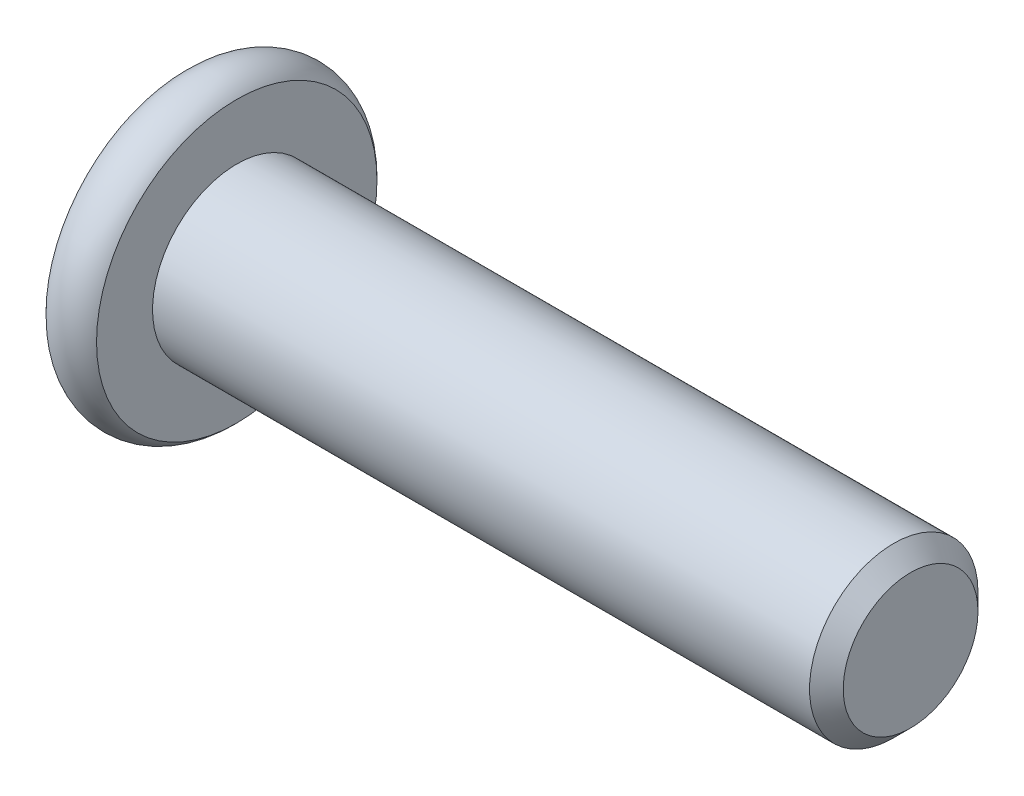
ISO-10303-21;
HEADER;
FILE_DESCRIPTION(('STEP AP214'),'2;1');
FILE_NAME('part.step','',(''),(''),'','','');
FILE_SCHEMA(('AUTOMOTIVE_DESIGN { 1 0 10303 214 1 1 1 1 }'));
ENDSEC;
DATA;
#1=APPLICATION_CONTEXT('core data for automotive mechanical design processes');
#2=APPLICATION_PROTOCOL_DEFINITION('international standard','automotive_design',2000,#1);
#3=PRODUCT_CONTEXT('',#1,'mechanical');
#4=PRODUCT('Part','Part','',(#3));
#5=PRODUCT_RELATED_PRODUCT_CATEGORY('part','',(#4));
#6=PRODUCT_DEFINITION_FORMATION('','',#4);
#7=PRODUCT_DEFINITION_CONTEXT('part definition',#1,'design');
#8=PRODUCT_DEFINITION('design','',#6,#7);
#9=PRODUCT_DEFINITION_SHAPE('','',#8);
#10=(LENGTH_UNIT() NAMED_UNIT(*) SI_UNIT(.MILLI.,.METRE.));
#11=(NAMED_UNIT(*) PLANE_ANGLE_UNIT() SI_UNIT($,.RADIAN.));
#12=(NAMED_UNIT(*) SI_UNIT($,.STERADIAN.) SOLID_ANGLE_UNIT());
#13=UNCERTAINTY_MEASURE_WITH_UNIT(LENGTH_MEASURE(1.E-05),#10,'distance_accuracy_value','');
#14=(GEOMETRIC_REPRESENTATION_CONTEXT(3) GLOBAL_UNCERTAINTY_ASSIGNED_CONTEXT((#13)) GLOBAL_UNIT_ASSIGNED_CONTEXT((#10,
#11,#12)) REPRESENTATION_CONTEXT('',''));
#15=CARTESIAN_POINT('',(0.,0.,0.));
#16=DIRECTION('',(0.,0.,1.));
#17=DIRECTION('',(1.,0.,0.));
#18=AXIS2_PLACEMENT_3D('',#15,#16,#17);
#19=CARTESIAN_POINT('',(-20.,0.,2.22044604925031E-13));
#20=DIRECTION('',(1.,0.,0.));
#21=DIRECTION('',(0.,0.,-1.));
#22=AXIS2_PLACEMENT_3D('',#19,#20,#21);
#23=CYLINDRICAL_SURFACE('',#22,2.5);
#24=CARTESIAN_POINT('',(-0.500000000000056,0.,0.));
#25=DIRECTION('',(1.,0.,0.));
#26=DIRECTION('',(0.,0.,-1.));
#27=AXIS2_PLACEMENT_3D('',#24,#25,#26);
#28=CIRCLE('',#27,2.5);
#29=CARTESIAN_POINT('',(-0.500000000000056,0.,-2.5));
#30=VERTEX_POINT('',#29);
#31=EDGE_CURVE('E48',#30,#30,#28,.F.);
#32=ORIENTED_EDGE('',*,*,#31,.T.);
#33=EDGE_LOOP('',(#32));
#34=FACE_BOUND('',#33,.T.);
#35=CARTESIAN_POINT('',(-20.,0.,2.22044604925031E-13));
#36=DIRECTION('',(-1.,0.,0.));
#37=DIRECTION('',(0.,-1.,0.));
#38=AXIS2_PLACEMENT_3D('',#35,#36,#37);
#39=CIRCLE('',#38,2.5);
#40=CARTESIAN_POINT('',(-20.,-2.50000000000006,2.22183382803109E-13));
#41=VERTEX_POINT('',#40);
#42=EDGE_CURVE('E124',#41,#41,#39,.F.);
#43=ORIENTED_EDGE('',*,*,#42,.T.);
#44=EDGE_LOOP('',(#43));
#45=FACE_BOUND('',#44,.T.);
#46=ADVANCED_FACE('F34',(#34,#45),#23,.T.);
#47=CARTESIAN_POINT('',(0.,0.,0.));
#48=DIRECTION('',(1.,0.,0.));
#49=DIRECTION('',(0.,0.,-1.));
#50=AXIS2_PLACEMENT_3D('',#47,#48,#49);
#51=PLANE('',#50);
#52=CARTESIAN_POINT('',(0.,0.,0.));
#53=DIRECTION('',(1.,0.,0.));
#54=DIRECTION('',(0.,0.,-1.));
#55=AXIS2_PLACEMENT_3D('',#52,#53,#54);
#56=CIRCLE('',#55,2.);
#57=CARTESIAN_POINT('',(0.,0.,-2.));
#58=VERTEX_POINT('',#57);
#59=EDGE_CURVE('E127',#58,#58,#56,.T.);
#60=ORIENTED_EDGE('',*,*,#59,.T.);
#61=EDGE_LOOP('',(#60));
#62=FACE_BOUND('',#61,.T.);
#63=ADVANCED_FACE('F137',(#62),#51,.T.);
#64=CARTESIAN_POINT('',(0.,0.,0.));
#65=DIRECTION('',(-1.,0.,0.));
#66=DIRECTION('',(0.,0.,1.));
#67=AXIS2_PLACEMENT_3D('',#64,#65,#66);
#68=CONICAL_SURFACE('',#67,2.,0.785398163397446);
#69=ORIENTED_EDGE('',*,*,#31,.F.);
#70=EDGE_LOOP('',(#69));
#71=FACE_BOUND('',#70,.T.);
#72=ORIENTED_EDGE('',*,*,#59,.F.);
#73=EDGE_LOOP('',(#72));
#74=FACE_BOUND('',#73,.T.);
#75=ADVANCED_FACE('F36',(#71,#74),#68,.T.);
#76=CARTESIAN_POINT('',(-21.5,0.,2.22044604925031E-13));
#77=DIRECTION('',(1.,0.,0.));
#78=DIRECTION('',(0.,1.,0.));
#79=AXIS2_PLACEMENT_3D('',#76,#77,#78);
#80=PLANE('',#79);
#81=CARTESIAN_POINT('',(-21.5,1.66533453693773E-13,0.));
#82=DIRECTION('',(-1.,0.,0.));
#83=DIRECTION('',(0.,-1.,0.));
#84=AXIS2_PLACEMENT_3D('',#81,#82,#83);
#85=CIRCLE('',#84,1.78205080756886);
#86=CARTESIAN_POINT('',(-21.5,-1.78205080756869,0.));
#87=VERTEX_POINT('',#86);
#88=EDGE_CURVE('E242',#87,#87,#85,.T.);
#89=ORIENTED_EDGE('',*,*,#88,.F.);
#90=EDGE_LOOP('',(#89));
#91=FACE_BOUND('',#90,.T.);
#92=CARTESIAN_POINT('',(-21.5,0.,2.22044604925031E-13));
#93=DIRECTION('',(-1.,0.,0.));
#94=DIRECTION('',(0.,-1.,0.));
#95=AXIS2_PLACEMENT_3D('',#92,#93,#94);
#96=CIRCLE('',#95,4.16143782776615);
#97=CARTESIAN_POINT('',(-21.5,-4.16143782776621,2.22275611129628E-13));
#98=VERTEX_POINT('',#97);
#99=EDGE_CURVE('E121',#98,#98,#96,.T.);
#100=ORIENTED_EDGE('',*,*,#99,.T.);
#101=EDGE_LOOP('',(#100));
#102=FACE_BOUND('',#101,.T.);
#103=ADVANCED_FACE('F136',(#91,#102),#80,.F.);
#104=CARTESIAN_POINT('',(-20.75,0.,2.22044604925031E-13));
#105=DIRECTION('',(-1.,0.,0.));
#106=DIRECTION('',(0.,-1.,0.));
#107=AXIS2_PLACEMENT_3D('',#104,#105,#106);
#108=TOROIDAL_SURFACE('',#107,3.5,1.);
#109=ORIENTED_EDGE('',*,*,#99,.F.);
#110=EDGE_LOOP('',(#109));
#111=FACE_BOUND('',#110,.T.);
#112=CARTESIAN_POINT('',(-20.,0.,2.22044604925031E-13));
#113=DIRECTION('',(-1.,0.,0.));
#114=DIRECTION('',(0.,-1.,0.));
#115=AXIS2_PLACEMENT_3D('',#112,#113,#114);
#116=CIRCLE('',#115,4.16143782776615);
#117=CARTESIAN_POINT('',(-20.,-4.16143782776621,2.22275611129628E-13));
#118=VERTEX_POINT('',#117);
#119=EDGE_CURVE('E118',#118,#118,#116,.T.);
#120=ORIENTED_EDGE('',*,*,#119,.T.);
#121=EDGE_LOOP('',(#120));
#122=FACE_BOUND('',#121,.T.);
#123=ADVANCED_FACE('F148',(#111,#122),#108,.T.);
#124=CARTESIAN_POINT('',(-20.,4.16143782776629,2.22044604925031E-13));
#125=DIRECTION('',(-1.,0.,0.));
#126=DIRECTION('',(0.,-1.,0.));
#127=AXIS2_PLACEMENT_3D('',#124,#125,#126);
#128=PLANE('',#127);
#129=ORIENTED_EDGE('',*,*,#42,.F.);
#130=EDGE_LOOP('',(#129));
#131=FACE_BOUND('',#130,.T.);
#132=ORIENTED_EDGE('',*,*,#119,.F.);
#133=EDGE_LOOP('',(#132));
#134=FACE_BOUND('',#133,.T.);
#135=ADVANCED_FACE('F152',(#131,#134),#128,.F.);
#136=CARTESIAN_POINT('',(-21.5,1.66533453693773E-13,0.));
#137=DIRECTION('',(-1.,0.,0.));
#138=DIRECTION('',(0.,-1.,0.));
#139=AXIS2_PLACEMENT_3D('',#136,#137,#138);
#140=CONICAL_SURFACE('',#139,1.78205080756886,0.78539816339745);
#141=ORIENTED_EDGE('',*,*,#88,.T.);
#142=EDGE_LOOP('',(#141));
#143=FACE_BOUND('',#142,.T.);
#144=CARTESIAN_POINT('',(-22.015428085613,-1.74023253176592,1.50000000000039));
#145=CARTESIAN_POINT('',(-21.9833811073447,-1.69791724929735,1.50000000000032));
#146=CARTESIAN_POINT('',(-21.9516444672843,-1.65536760966792,1.50000000000029));
#147=CARTESIAN_POINT('',(-21.8889203936156,-1.56970398156683,1.50000000000027));
#148=CARTESIAN_POINT('',(-21.8579331482203,-1.52658985542849,1.50000000000028));
#149=CARTESIAN_POINT('',(-21.7658461643452,-1.39562626326564,1.50000000000028));
#150=CARTESIAN_POINT('',(-21.7061145123023,-1.30679868010574,1.50000000000026));
#151=CARTESIAN_POINT('',(-21.5887342891015,-1.12044622640207,1.5000000000003));
#152=CARTESIAN_POINT('',(-21.5314082774826,-1.0227158730666,1.50000000000037));
#153=CARTESIAN_POINT('',(-21.4264632149761,-0.822357214965245,1.50000000000019));
#154=CARTESIAN_POINT('',(-21.3788114236894,-0.719746931702063,1.49999999999994));
#155=CARTESIAN_POINT('',(-21.3205099883151,-0.56585238709519,1.50000000000011));
#156=CARTESIAN_POINT('',(-21.3037990535411,-0.51687419142472,1.50000000000024));
#157=CARTESIAN_POINT('',(-21.2743077515092,-0.41772398845751,1.50000000000032));
#158=CARTESIAN_POINT('',(-21.2615276514222,-0.367551900263887,1.50000000000027));
#159=CARTESIAN_POINT('',(-21.240778420246,-0.267158299056132,1.50000000000028));
#160=CARTESIAN_POINT('',(-21.2327260618263,-0.216954261864853,1.50000000000034));
#161=CARTESIAN_POINT('',(-21.2215916368342,-0.115994915871317,1.50000000000022));
#162=CARTESIAN_POINT('',(-21.2185086886377,-0.0652397064615469,1.50000000000005));
#163=CARTESIAN_POINT('',(-21.2175473897404,0.0344222234875186,1.50000000000006));
#164=CARTESIAN_POINT('',(-21.2194789216953,0.0833271701100345,1.50000000000022));
#165=CARTESIAN_POINT('',(-21.228017572968,0.18072429312715,1.50000000000033));
#166=CARTESIAN_POINT('',(-21.2346251420483,0.229216429361659,1.50000000000028));
#167=CARTESIAN_POINT('',(-21.2522650626449,0.32625802769693,1.50000000000027));
#168=CARTESIAN_POINT('',(-21.2633731682012,0.37479350744994,1.50000000000032));
#169=CARTESIAN_POINT('',(-21.2894198669597,0.470802295834104,1.50000000000024));
#170=CARTESIAN_POINT('',(-21.3043581560035,0.518275688481227,1.50000000000011));
#171=CARTESIAN_POINT('',(-21.3568395457159,0.667150562065092,1.49999999999994));
#172=CARTESIAN_POINT('',(-21.4003351165442,0.766448362426739,1.50000000000019));
#173=CARTESIAN_POINT('',(-21.4970587814838,0.960384405673684,1.50000000000037));
#174=CARTESIAN_POINT('',(-21.5503217226675,1.05500437383609,1.50000000000031));
#175=CARTESIAN_POINT('',(-21.6602258010454,1.23584520321524,1.50000000000025));
#176=CARTESIAN_POINT('',(-21.7165682531047,1.32224986946543,1.50000000000026));
#177=CARTESIAN_POINT('',(-21.8036755725971,1.44954953726468,1.50000000000029));
#178=CARTESIAN_POINT('',(-21.8330199906839,1.49143368482417,1.5000000000003));
#179=CARTESIAN_POINT('',(-21.8924869182931,1.57462914783238,1.50000000000026));
#180=CARTESIAN_POINT('',(-21.9226092115007,1.61594061772573,1.50000000000019));
#181=CARTESIAN_POINT('',(-21.9530541181365,1.65701358742548,1.50000000000006));
#182=B_SPLINE_CURVE_WITH_KNOTS('',3,(#144,#145,#146,#147,#148,#149,#150,#151,#152,#153,#154,
#155,#156,#157,#158,#159,#160,#161,#162,#163,#164,#165,#166,#167,#168,#169,#170,#171,#172,#173,
#174,#175,#176,#177,#178,#179,#180,#181),.UNSPECIFIED.,.F.,.F.,(4,2,2,2,2,2,2,2,2,2,2,2,2,2,2,2,
2,2,4),(0.,0.159238974218315,0.318517535014476,0.639504781932392,0.979137893799231,
1.31760168934353,1.47272233841619,1.62785352839773,1.78016486537347,1.93244917778278,
2.07904486260292,2.22565464958326,2.37484213303392,2.52401777304029,2.8482836528376,
3.17372975666736,3.48303030530528,3.63644667013898,3.78982082222899),.UNSPECIFIED.);
#183=CARTESIAN_POINT('',(-21.4500000000001,-0.866025403784554,1.50000000000028));
#184=VERTEX_POINT('',#183);
#185=CARTESIAN_POINT('',(-21.45,0.866025403784387,1.50000000000017));
#186=VERTEX_POINT('',#185);
#187=EDGE_CURVE('E102',#184,#186,#182,.T.);
#188=ORIENTED_EDGE('',*,*,#187,.F.);
#189=CARTESIAN_POINT('',(-21.4501154816001,-1.73216627762274,-0.000199999999672684));
#190=CARTESIAN_POINT('',(-21.4203654760676,-1.70239359975924,0.0513677907374837));
#191=CARTESIAN_POINT('',(-21.3923624839106,-1.67212305186367,0.103797917665623));
#192=CARTESIAN_POINT('',(-21.3410892304405,-1.61039789003631,0.21070903405604));
#193=CARTESIAN_POINT('',(-21.3178475050447,-1.57893740312624,0.265200195815113));
#194=CARTESIAN_POINT('',(-21.2780337289926,-1.51549879897996,0.375079081357747));
#195=CARTESIAN_POINT('',(-21.2613615856714,-1.48353684526821,0.430438809095736));
#196=CARTESIAN_POINT('',(-21.2356744568184,-1.41890915196216,0.542377257477631));
#197=CARTESIAN_POINT('',(-21.2266402904789,-1.38624538781116,0.598952556553395));
#198=CARTESIAN_POINT('',(-21.218489081227,-1.32995210095303,0.696455389516801));
#199=CARTESIAN_POINT('',(-21.2172822529896,-1.30639533311136,0.737256908280851));
#200=CARTESIAN_POINT('',(-21.2193140571628,-1.25932335290211,0.818787969616243));
#201=CARTESIAN_POINT('',(-21.2225536707488,-1.23580815085328,0.859517494314989));
#202=CARTESIAN_POINT('',(-21.2332919859824,-1.18900414978446,0.940584402163756));
#203=CARTESIAN_POINT('',(-21.2407946530193,-1.16571558211746,0.980921384598634));
#204=CARTESIAN_POINT('',(-21.2596516119287,-1.11952932016346,1.0609183369143));
#205=CARTESIAN_POINT('',(-21.2710075570187,-1.09663179808774,1.10057800851639));
#206=CARTESIAN_POINT('',(-21.3047216475926,-1.03798159809673,1.2021631347746));
#207=CARTESIAN_POINT('',(-21.3296218490937,-1.00259267147477,1.26345855370988));
#208=CARTESIAN_POINT('',(-21.371656653272,-0.950557780604678,1.35358562846354));
#209=CARTESIAN_POINT('',(-21.3864251535596,-0.933410759677447,1.38328513990795));
#210=CARTESIAN_POINT('',(-21.4173105659405,-0.899432101996583,1.44213790138397));
#211=CARTESIAN_POINT('',(-21.4334268341219,-0.882600319285768,1.47129140422083));
#212=CARTESIAN_POINT('',(-21.4501154816001,-0.86590993373048,1.50020000000017));
#213=B_SPLINE_CURVE_WITH_KNOTS('',3,(#189,#190,#191,#192,#193,#194,#195,#196,#197,#198,#199,
#200,#201,#202,#203,#204,#205,#206,#207,#208,#209,#210,#211,#212),.UNSPECIFIED.,.F.,.F.,(4,2,2,
2,2,2,2,2,2,2,2,4),(0.,0.199829143693217,0.400822987382367,0.598623720538195,0.795926240188856,
0.937113067959762,1.07833105577178,1.21968061668202,1.36109089931028,1.58570969637538,
1.69770705470938,1.80965120737165),.UNSPECIFIED.);
#214=CARTESIAN_POINT('',(-21.4500000000001,-1.732050807569,4.44089209850063E-13));
#215=VERTEX_POINT('',#214);
#216=EDGE_CURVE('E198',#215,#184,#213,.T.);
#217=ORIENTED_EDGE('',*,*,#216,.F.);
#218=CARTESIAN_POINT('',(-21.4501154816001,-0.865909933730591,-1.50019999999984));
#219=CARTESIAN_POINT('',(-21.4203654760674,-0.895682611594249,-1.44863220926284));
#220=CARTESIAN_POINT('',(-21.3923624839104,-0.925953159489866,-1.39620208233474));
#221=CARTESIAN_POINT('',(-21.3410892304403,-0.987678321317225,-1.28929096594437));
#222=CARTESIAN_POINT('',(-21.3178475050445,-1.01913880822726,-1.2347998041853));
#223=CARTESIAN_POINT('',(-21.2780337289924,-1.08257741237355,-1.12492091864272));
#224=CARTESIAN_POINT('',(-21.2613615856711,-1.11453936608537,-1.06956119090479));
#225=CARTESIAN_POINT('',(-21.2356744568182,-1.17916705939124,-0.95762274252279));
#226=CARTESIAN_POINT('',(-21.2266402904789,-1.21183082354201,-0.901047443446861));
#227=CARTESIAN_POINT('',(-21.2184890812269,-1.26812411040024,-0.80354461048347));
#228=CARTESIAN_POINT('',(-21.2172822529894,-1.29168087824212,-0.762743091719508));
#229=CARTESIAN_POINT('',(-21.2193140571625,-1.33875285845151,-0.681212030384146));
#230=CARTESIAN_POINT('',(-21.2225536707485,-1.36226806050028,-0.640482505685342));
#231=CARTESIAN_POINT('',(-21.2332919859822,-1.40907206156915,-0.559415597836548));
#232=CARTESIAN_POINT('',(-21.240794653019,-1.43236062923625,-0.519078615401701));
#233=CARTESIAN_POINT('',(-21.2596516119285,-1.47854689119004,-0.439081663085886));
#234=CARTESIAN_POINT('',(-21.2710075570186,-1.50144441326544,-0.399421991483613));
#235=CARTESIAN_POINT('',(-21.3047216475926,-1.56009461325624,-0.297836865225293));
#236=CARTESIAN_POINT('',(-21.3296218490935,-1.5954835398787,-0.236541446290254));
#237=CARTESIAN_POINT('',(-21.3716566532718,-1.64751843074903,-0.146414371536723));
#238=CARTESIAN_POINT('',(-21.3864251535594,-1.66466545167626,-0.116714860092322));
#239=CARTESIAN_POINT('',(-21.4173105659404,-1.69864410935695,-0.057862098616249));
#240=CARTESIAN_POINT('',(-21.4334268341218,-1.71547589206759,-0.0287085957793187));
#241=CARTESIAN_POINT('',(-21.4501154816001,-1.73216627762263,0.000200000000116773));
#242=B_SPLINE_CURVE_WITH_KNOTS('',3,(#218,#219,#220,#221,#222,#223,#224,#225,#226,#227,#228,
#229,#230,#231,#232,#233,#234,#235,#236,#237,#238,#239,#240,#241),.UNSPECIFIED.,.F.,.F.,(4,2,2,
2,2,2,2,2,2,2,2,4),(0.,0.199829143693239,0.400822987382314,0.598623720538103,0.795926240188776,
0.937113067959776,1.07833105577185,1.21968061668216,1.3610908993105,1.58570969637556,
1.69770705470953,1.8096512073718),.UNSPECIFIED.);
#243=CARTESIAN_POINT('',(-21.4500000000001,-0.866025403784554,-1.49999999999995));
#244=VERTEX_POINT('',#243);
#245=EDGE_CURVE('E192',#244,#215,#242,.T.);
#246=ORIENTED_EDGE('',*,*,#245,.F.);
#247=CARTESIAN_POINT('',(-22.015428085613,-1.74023253176575,-1.49999999999972));
#248=CARTESIAN_POINT('',(-21.9833811073446,-1.69791724929724,-1.5));
#249=CARTESIAN_POINT('',(-21.9516444672842,-1.65536760966783,-1.50000000000012));
#250=CARTESIAN_POINT('',(-21.8889203936154,-1.56970398156675,-1.50000000000021));
#251=CARTESIAN_POINT('',(-21.8579331482201,-1.52658985542839,-1.50000000000019));
#252=CARTESIAN_POINT('',(-21.7658461643451,-1.39562626326554,-1.50000000000013));
#253=CARTESIAN_POINT('',(-21.7061145123022,-1.30679868010565,-1.50000000000013));
#254=CARTESIAN_POINT('',(-21.5887342891013,-1.12044622640201,-1.50000000000021));
#255=CARTESIAN_POINT('',(-21.5314082774824,-1.02271587306655,-1.5000000000003));
#256=CARTESIAN_POINT('',(-21.426463214976,-0.822357214965113,-1.50000000000003));
#257=CARTESIAN_POINT('',(-21.3788114236895,-0.719746931701838,-1.49999999999967));
#258=CARTESIAN_POINT('',(-21.320509988315,-0.56585238709499,-1.49999999999991));
#259=CARTESIAN_POINT('',(-21.303799053541,-0.516874191424563,-1.5000000000001));
#260=CARTESIAN_POINT('',(-21.2743077515091,-0.417723988457403,-1.50000000000023));
#261=CARTESIAN_POINT('',(-21.2615276514221,-0.367551900263786,-1.50000000000018));
#262=CARTESIAN_POINT('',(-21.2407784202459,-0.26715829905606,-1.50000000000016));
#263=CARTESIAN_POINT('',(-21.2327260618261,-0.216954261864804,-1.50000000000019));
#264=CARTESIAN_POINT('',(-21.2215916368341,-0.115994915871298,-1.50000000000014));
#265=CARTESIAN_POINT('',(-21.2185086886377,-0.0652397064615371,-1.50000000000005));
#266=CARTESIAN_POINT('',(-21.2175473897404,0.0344222234875172,-1.50000000000006));
#267=CARTESIAN_POINT('',(-21.2194789216952,0.0833271701100311,-1.50000000000014));
#268=CARTESIAN_POINT('',(-21.2280175729678,0.180724293127133,-1.50000000000019));
#269=CARTESIAN_POINT('',(-21.2346251420481,0.22921642936163,-1.50000000000016));
#270=CARTESIAN_POINT('',(-21.2522650626448,0.326258027696887,-1.50000000000018));
#271=CARTESIAN_POINT('',(-21.263373168201,0.374793507449896,-1.50000000000023));
#272=CARTESIAN_POINT('',(-21.2894198669596,0.470802295834032,-1.5000000000001));
#273=CARTESIAN_POINT('',(-21.3043581560035,0.518275688481128,-1.49999999999991));
#274=CARTESIAN_POINT('',(-21.3568395457159,0.667150562064988,-1.49999999999967));
#275=CARTESIAN_POINT('',(-21.4003351165442,0.766448362426712,-1.50000000000003));
#276=CARTESIAN_POINT('',(-21.4970587814836,0.960384405673728,-1.5000000000003));
#277=CARTESIAN_POINT('',(-21.5503217226675,1.05500437383613,-1.5000000000002));
#278=CARTESIAN_POINT('',(-21.6602258010453,1.23584520321528,-1.50000000000013));
#279=CARTESIAN_POINT('',(-21.7165682531046,1.32224986946547,-1.50000000000015));
#280=CARTESIAN_POINT('',(-21.803675572597,1.44954953726472,-1.50000000000017));
#281=CARTESIAN_POINT('',(-21.8330199906839,1.49143368482422,-1.50000000000018));
#282=CARTESIAN_POINT('',(-21.892486918293,1.57462914783244,-1.50000000000015));
#283=CARTESIAN_POINT('',(-21.9226092115007,1.61594061772579,-1.50000000000012));
#284=CARTESIAN_POINT('',(-21.9530541181365,1.65701358742554,-1.50000000000006));
#285=B_SPLINE_CURVE_WITH_KNOTS('',3,(#247,#248,#249,#250,#251,#252,#253,#254,#255,#256,#257,
#258,#259,#260,#261,#262,#263,#264,#265,#266,#267,#268,#269,#270,#271,#272,#273,#274,#275,#276,
#277,#278,#279,#280,#281,#282,#283,#284),.UNSPECIFIED.,.F.,.F.,(4,2,2,2,2,2,2,2,2,2,2,2,2,2,2,2,
2,2,4),(0.,0.159238974218338,0.318517535014512,0.639504781932395,0.979137893799249,
1.31760168934362,1.47272233841624,1.62785352839773,1.78016486537341,1.93244917778268,
2.07904486260281,2.22565464958312,2.37484213303376,2.52401777304011,2.8482836528375,
3.17372975666731,3.48303030530522,3.63644667013894,3.78982082222898),.UNSPECIFIED.);
#286=CARTESIAN_POINT('',(-21.45,0.866025403784332,-1.50000000000017));
#287=VERTEX_POINT('',#286);
#288=EDGE_CURVE('E55',#287,#244,#285,.F.);
#289=ORIENTED_EDGE('',*,*,#288,.F.);
#290=CARTESIAN_POINT('',(-21.4501154816001,1.73216627762252,0.000200000000338818));
#291=CARTESIAN_POINT('',(-21.4203654760673,1.70239359975915,-0.0513677907368243));
#292=CARTESIAN_POINT('',(-21.3923624839102,1.67212305186364,-0.103797917665));
#293=CARTESIAN_POINT('',(-21.3410892304401,1.61039789003635,-0.210709034055433));
#294=CARTESIAN_POINT('',(-21.3178475050443,1.57893740312629,-0.265200195814482));
#295=CARTESIAN_POINT('',(-21.2780337289921,1.51549879897999,-0.375079081357035));
#296=CARTESIAN_POINT('',(-21.2613615856707,1.4835368452682,-0.430438809094967));
#297=CARTESIAN_POINT('',(-21.235674456818,1.41890915196228,-0.54237725747699));
#298=CARTESIAN_POINT('',(-21.226640290479,1.38624538781144,-0.598952556552939));
#299=CARTESIAN_POINT('',(-21.2184890812269,1.3299521009532,-0.696455389516378));
#300=CARTESIAN_POINT('',(-21.2172822529891,1.30639533311136,-0.737256908280361));
#301=CARTESIAN_POINT('',(-21.2193140571621,1.25932335290199,-0.818787969615715));
#302=CARTESIAN_POINT('',(-21.2225536707481,1.2358081508532,-0.859517494314492));
#303=CARTESIAN_POINT('',(-21.2332919859818,1.18900414978437,-0.940584402163314));
#304=CARTESIAN_POINT('',(-21.2407946530185,1.16571558211734,-0.980921384598216));
#305=CARTESIAN_POINT('',(-21.2596516119282,1.11952932016337,-1.06091833691387));
#306=CARTESIAN_POINT('',(-21.2710075570186,1.09663179808773,-1.10057800851593));
#307=CARTESIAN_POINT('',(-21.3047216475927,1.03798159809675,-1.20216313477417));
#308=CARTESIAN_POINT('',(-21.3296218490933,1.00259267147464,-1.26345855370959));
#309=CARTESIAN_POINT('',(-21.3716566532714,0.950557780604432,-1.35358562846332));
#310=CARTESIAN_POINT('',(-21.386425153559,0.933410759677186,-1.38328513990773));
#311=CARTESIAN_POINT('',(-21.4173105659401,0.899432101996403,-1.44213790138374));
#312=CARTESIAN_POINT('',(-21.4334268341217,0.882600319285683,-1.4712914042206));
#313=CARTESIAN_POINT('',(-21.4501154816001,0.865909933730591,-1.50019999999995));
#314=B_SPLINE_CURVE_WITH_KNOTS('',3,(#290,#291,#292,#293,#294,#295,#296,#297,#298,#299,#300,
#301,#302,#303,#304,#305,#306,#307,#308,#309,#310,#311,#312,#313),.UNSPECIFIED.,.F.,.F.,(4,2,2,
2,2,2,2,2,2,2,2,4),(0.,0.199829143693358,0.400822987382412,0.598623720538207,0.795926240188963,
0.937113067959984,1.07833105577203,1.21968061668233,1.36109089931066,1.58570969637585,
1.69770705470987,1.80965120737222),.UNSPECIFIED.);
#315=CARTESIAN_POINT('',(-21.45,1.73205080756905,0.));
#316=VERTEX_POINT('',#315);
#317=EDGE_CURVE('E11',#316,#287,#314,.T.);
#318=ORIENTED_EDGE('',*,*,#317,.F.);
#319=CARTESIAN_POINT('',(-21.4501154816001,0.865909933730757,1.50020000000017));
#320=CARTESIAN_POINT('',(-21.4203654760673,0.8956826115942,1.44863220926306));
#321=CARTESIAN_POINT('',(-21.3923624839103,0.925953159489757,1.39620208233493));
#322=CARTESIAN_POINT('',(-21.3410892304401,0.987678321317076,1.28929096594456));
#323=CARTESIAN_POINT('',(-21.3178475050444,1.01913880822713,1.23479980418552));
#324=CARTESIAN_POINT('',(-21.2780337289922,1.08257741237336,1.12492091864298));
#325=CARTESIAN_POINT('',(-21.2613615856708,1.11453936608509,1.06956119090503));
#326=CARTESIAN_POINT('',(-21.2356744568181,1.17916705939113,0.957622742523144));
#327=CARTESIAN_POINT('',(-21.226640290479,1.21183082354216,0.901047443447341));
#328=CARTESIAN_POINT('',(-21.2184890812269,1.26812411040032,0.803544610483884));
#329=CARTESIAN_POINT('',(-21.2172822529891,1.291680878242,0.762743091719809));
#330=CARTESIAN_POINT('',(-21.2193140571621,1.33875285845126,0.681212030384383));
#331=CARTESIAN_POINT('',(-21.2225536707482,1.36226806050009,0.640482505685627));
#332=CARTESIAN_POINT('',(-21.2332919859818,1.40907206156896,0.559415597836825));
#333=CARTESIAN_POINT('',(-21.2407946530185,1.43236062923601,0.519078615401922));
#334=CARTESIAN_POINT('',(-21.2596516119281,1.47854689118992,0.439081663086229));
#335=CARTESIAN_POINT('',(-21.2710075570186,1.5014444132655,0.399421991484134));
#336=CARTESIAN_POINT('',(-21.3047216475927,1.56009461325645,0.297836865225866));
#337=CARTESIAN_POINT('',(-21.3296218490932,1.59548353987867,0.236541446290483));
#338=CARTESIAN_POINT('',(-21.3716566532714,1.64751843074893,0.146414371536749));
#339=CARTESIAN_POINT('',(-21.3864251535589,1.66466545167618,0.116714860092335));
#340=CARTESIAN_POINT('',(-21.41731056594,1.69864410935694,0.057862098616311));
#341=CARTESIAN_POINT('',(-21.4334268341217,1.71547589206765,0.0287085957794427));
#342=CARTESIAN_POINT('',(-21.4501154816001,1.73216627762274,-0.000199999999894729));
#343=B_SPLINE_CURVE_WITH_KNOTS('',3,(#319,#320,#321,#322,#323,#324,#325,#326,#327,#328,#329,
#330,#331,#332,#333,#334,#335,#336,#337,#338,#339,#340,#341,#342),.UNSPECIFIED.,.F.,.F.,(4,2,2,
2,2,2,2,2,2,2,2,4),(0.,0.199829143693294,0.400822987382295,0.598623720538023,0.795926240188707,
0.937113067959731,1.07833105577178,1.21968061668208,1.36109089931043,1.58570969637565,
1.69770705470968,1.80965120737205),.UNSPECIFIED.);
#344=EDGE_CURVE('E93',#186,#316,#343,.T.);
#345=ORIENTED_EDGE('',*,*,#344,.F.);
#346=EDGE_LOOP('',(#188,#217,#246,#289,#318,#345));
#347=FACE_BOUND('',#346,.T.);
#348=ADVANCED_FACE('F92',(#143,#347),#140,.F.);
#349=CARTESIAN_POINT('',(-19.2,1.11022302462516E-13,2.22044604925031E-13));
#350=DIRECTION('',(-1.,0.,0.));
#351=DIRECTION('',(0.,-1.,0.));
#352=AXIS2_PLACEMENT_3D('',#349,#350,#351);
#353=PLANE('',#352);
#354=DIRECTION('',(0.,0.5,-0.866025403784439));
#355=VECTOR('',#354,1.);
#356=CARTESIAN_POINT('',(-19.2,0.866025403784387,1.50000000000017));
#357=LINE('',#356,#355);
#358=CARTESIAN_POINT('',(-19.2,0.866025403784387,1.50000000000017));
#359=VERTEX_POINT('',#358);
#360=CARTESIAN_POINT('',(-19.2,1.73205080756889,0.));
#361=VERTEX_POINT('',#360);
#362=EDGE_CURVE('E101',#359,#361,#357,.T.);
#363=ORIENTED_EDGE('',*,*,#362,.T.);
#364=DIRECTION('',(0.,-0.5,-0.86602540378444));
#365=VECTOR('',#364,1.);
#366=CARTESIAN_POINT('',(-19.2,1.73205080756889,0.));
#367=LINE('',#366,#365);
#368=CARTESIAN_POINT('',(-19.2,0.866025403784332,-1.50000000000017));
#369=VERTEX_POINT('',#368);
#370=EDGE_CURVE('E106',#361,#369,#367,.T.);
#371=ORIENTED_EDGE('',*,*,#370,.T.);
#372=DIRECTION('',(0.,-1.,0.));
#373=VECTOR('',#372,1.);
#374=CARTESIAN_POINT('',(-19.2,0.866025403784332,-1.50000000000017));
#375=LINE('',#374,#373);
#376=CARTESIAN_POINT('',(-19.2,-0.866025403784554,-1.49999999999995));
#377=VERTEX_POINT('',#376);
#378=EDGE_CURVE('E224',#369,#377,#375,.T.);
#379=ORIENTED_EDGE('',*,*,#378,.T.);
#380=DIRECTION('',(0.,-0.5,0.866025403784439));
#381=VECTOR('',#380,1.);
#382=CARTESIAN_POINT('',(-19.2,-0.866025403784554,-1.49999999999995));
#383=LINE('',#382,#381);
#384=CARTESIAN_POINT('',(-19.2,-1.732050807569,4.44089209850063E-13));
#385=VERTEX_POINT('',#384);
#386=EDGE_CURVE('E228',#377,#385,#383,.T.);
#387=ORIENTED_EDGE('',*,*,#386,.T.);
#388=DIRECTION('',(0.,0.5,0.86602540378444));
#389=VECTOR('',#388,1.);
#390=CARTESIAN_POINT('',(-19.2,-1.732050807569,4.44089209850063E-13));
#391=LINE('',#390,#389);
#392=CARTESIAN_POINT('',(-19.2,-0.866025403784554,1.50000000000028));
#393=VERTEX_POINT('',#392);
#394=EDGE_CURVE('E114',#385,#393,#391,.T.);
#395=ORIENTED_EDGE('',*,*,#394,.T.);
#396=DIRECTION('',(0.,1.,0.));
#397=VECTOR('',#396,1.);
#398=CARTESIAN_POINT('',(-19.2,-0.866025403784554,1.50000000000028));
#399=LINE('',#398,#397);
#400=EDGE_CURVE('E109',#393,#359,#399,.T.);
#401=ORIENTED_EDGE('',*,*,#400,.T.);
#402=EDGE_LOOP('',(#363,#371,#379,#387,#395,#401));
#403=FACE_BOUND('',#402,.T.);
#404=ADVANCED_FACE('F178',(#403),#353,.T.);
#405=CARTESIAN_POINT('',(-19.2,1.73205080756889,0.));
#406=DIRECTION('',(0.,0.866025403784439,-0.5));
#407=DIRECTION('',(0.,0.5,0.866025403784439));
#408=AXIS2_PLACEMENT_3D('',#405,#406,#407);
#409=PLANE('',#408);
#410=DIRECTION('',(-1.,0.,0.));
#411=VECTOR('',#410,1.);
#412=CARTESIAN_POINT('',(-19.2,1.73205080756889,0.));
#413=LINE('',#412,#411);
#414=EDGE_CURVE('E99',#361,#316,#413,.T.);
#415=ORIENTED_EDGE('',*,*,#414,.T.);
#416=ORIENTED_EDGE('',*,*,#317,.T.);
#417=DIRECTION('',(-1.,0.,0.));
#418=VECTOR('',#417,1.);
#419=CARTESIAN_POINT('',(-19.2,0.866025403784332,-1.50000000000017));
#420=LINE('',#419,#418);
#421=EDGE_CURVE('E108',#369,#287,#420,.T.);
#422=ORIENTED_EDGE('',*,*,#421,.F.);
#423=ORIENTED_EDGE('',*,*,#370,.F.);
#424=EDGE_LOOP('',(#415,#416,#422,#423));
#425=FACE_BOUND('',#424,.T.);
#426=ADVANCED_FACE('F104',(#425),#409,.F.);
#427=CARTESIAN_POINT('',(-19.2,0.866025403784332,-1.50000000000017));
#428=DIRECTION('',(0.,0.,-1.));
#429=DIRECTION('',(-1.,0.,0.));
#430=AXIS2_PLACEMENT_3D('',#427,#428,#429);
#431=PLANE('',#430);
#432=ORIENTED_EDGE('',*,*,#421,.T.);
#433=ORIENTED_EDGE('',*,*,#288,.T.);
#434=DIRECTION('',(-1.,0.,0.));
#435=VECTOR('',#434,1.);
#436=CARTESIAN_POINT('',(-19.2,-0.866025403784554,-1.49999999999995));
#437=LINE('',#436,#435);
#438=EDGE_CURVE('E111',#377,#244,#437,.T.);
#439=ORIENTED_EDGE('',*,*,#438,.F.);
#440=ORIENTED_EDGE('',*,*,#378,.F.);
#441=EDGE_LOOP('',(#432,#433,#439,#440));
#442=FACE_BOUND('',#441,.T.);
#443=ADVANCED_FACE('F213',(#442),#431,.F.);
#444=CARTESIAN_POINT('',(-19.2,-0.866025403784554,-1.49999999999995));
#445=DIRECTION('',(0.,-0.866025403784439,-0.5));
#446=DIRECTION('',(0.,0.500000000000001,-0.866025403784439));
#447=AXIS2_PLACEMENT_3D('',#444,#445,#446);
#448=PLANE('',#447);
#449=ORIENTED_EDGE('',*,*,#438,.T.);
#450=ORIENTED_EDGE('',*,*,#245,.T.);
#451=DIRECTION('',(-1.,0.,0.));
#452=VECTOR('',#451,1.);
#453=CARTESIAN_POINT('',(-19.2,-1.732050807569,4.44089209850063E-13));
#454=LINE('',#453,#452);
#455=EDGE_CURVE('E238',#385,#215,#454,.T.);
#456=ORIENTED_EDGE('',*,*,#455,.F.);
#457=ORIENTED_EDGE('',*,*,#386,.F.);
#458=EDGE_LOOP('',(#449,#450,#456,#457));
#459=FACE_BOUND('',#458,.T.);
#460=ADVANCED_FACE('F208',(#459),#448,.F.);
#461=CARTESIAN_POINT('',(-19.2,-1.732050807569,4.44089209850063E-13));
#462=DIRECTION('',(0.,-0.86602540378444,0.5));
#463=DIRECTION('',(0.,-0.5,-0.86602540378444));
#464=AXIS2_PLACEMENT_3D('',#461,#462,#463);
#465=PLANE('',#464);
#466=ORIENTED_EDGE('',*,*,#455,.T.);
#467=ORIENTED_EDGE('',*,*,#216,.T.);
#468=DIRECTION('',(-1.,0.,0.));
#469=VECTOR('',#468,1.);
#470=CARTESIAN_POINT('',(-19.2,-0.866025403784554,1.50000000000028));
#471=LINE('',#470,#469);
#472=EDGE_CURVE('E235',#393,#184,#471,.T.);
#473=ORIENTED_EDGE('',*,*,#472,.F.);
#474=ORIENTED_EDGE('',*,*,#394,.F.);
#475=EDGE_LOOP('',(#466,#467,#473,#474));
#476=FACE_BOUND('',#475,.T.);
#477=ADVANCED_FACE('F205',(#476),#465,.F.);
#478=CARTESIAN_POINT('',(-19.2,-0.866025403784554,1.50000000000028));
#479=DIRECTION('',(0.,0.,1.));
#480=DIRECTION('',(1.,0.,0.));
#481=AXIS2_PLACEMENT_3D('',#478,#479,#480);
#482=PLANE('',#481);
#483=ORIENTED_EDGE('',*,*,#472,.T.);
#484=ORIENTED_EDGE('',*,*,#187,.T.);
#485=DIRECTION('',(-1.,0.,0.));
#486=VECTOR('',#485,1.);
#487=CARTESIAN_POINT('',(-19.2,0.866025403784387,1.50000000000017));
#488=LINE('',#487,#486);
#489=EDGE_CURVE('E62',#359,#186,#488,.T.);
#490=ORIENTED_EDGE('',*,*,#489,.F.);
#491=ORIENTED_EDGE('',*,*,#400,.F.);
#492=EDGE_LOOP('',(#483,#484,#490,#491));
#493=FACE_BOUND('',#492,.T.);
#494=ADVANCED_FACE('F159',(#493),#482,.F.);
#495=CARTESIAN_POINT('',(-19.2,0.866025403784387,1.50000000000017));
#496=DIRECTION('',(0.,0.866025403784439,0.5));
#497=DIRECTION('',(0.,-0.5,0.866025403784439));
#498=AXIS2_PLACEMENT_3D('',#495,#496,#497);
#499=PLANE('',#498);
#500=ORIENTED_EDGE('',*,*,#489,.T.);
#501=ORIENTED_EDGE('',*,*,#344,.T.);
#502=ORIENTED_EDGE('',*,*,#414,.F.);
#503=ORIENTED_EDGE('',*,*,#362,.F.);
#504=EDGE_LOOP('',(#500,#501,#502,#503));
#505=FACE_BOUND('',#504,.T.);
#506=ADVANCED_FACE('F98',(#505),#499,.F.);
#507=CLOSED_SHELL('',(#46,#63,#75,#103,#123,#135,#348,#404,#426,#443,#460,#477,#494,#506));
#508=MANIFOLD_SOLID_BREP('B2',#507);
#509=ADVANCED_BREP_SHAPE_REPRESENTATION('',(#18,#508),#14);
#510=SHAPE_DEFINITION_REPRESENTATION(#9,#509);
ENDSEC;
END-ISO-10303-21;
